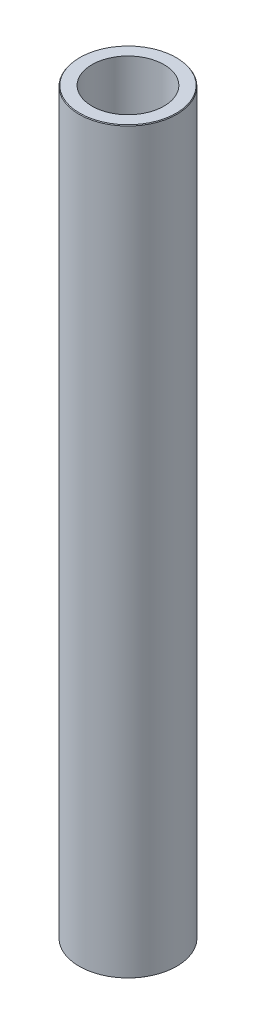
ISO-10303-21;
HEADER;
FILE_DESCRIPTION(('STEP AP214'),'2;1');
FILE_NAME('part.step','',(''),(''),'','','');
FILE_SCHEMA(('AUTOMOTIVE_DESIGN { 1 0 10303 214 1 1 1 1 }'));
ENDSEC;
DATA;
#1=APPLICATION_CONTEXT('core data for automotive mechanical design processes');
#2=APPLICATION_PROTOCOL_DEFINITION('international standard','automotive_design',2000,#1);
#3=PRODUCT_CONTEXT('',#1,'mechanical');
#4=PRODUCT('Part','Part','',(#3));
#5=PRODUCT_RELATED_PRODUCT_CATEGORY('part','',(#4));
#6=PRODUCT_DEFINITION_FORMATION('','',#4);
#7=PRODUCT_DEFINITION_CONTEXT('part definition',#1,'design');
#8=PRODUCT_DEFINITION('design','',#6,#7);
#9=PRODUCT_DEFINITION_SHAPE('','',#8);
#10=(LENGTH_UNIT() NAMED_UNIT(*) SI_UNIT(.MILLI.,.METRE.));
#11=(NAMED_UNIT(*) PLANE_ANGLE_UNIT() SI_UNIT($,.RADIAN.));
#12=(NAMED_UNIT(*) SI_UNIT($,.STERADIAN.) SOLID_ANGLE_UNIT());
#13=UNCERTAINTY_MEASURE_WITH_UNIT(LENGTH_MEASURE(1.E-05),#10,'distance_accuracy_value','');
#14=(GEOMETRIC_REPRESENTATION_CONTEXT(3) GLOBAL_UNCERTAINTY_ASSIGNED_CONTEXT((#13)) GLOBAL_UNIT_ASSIGNED_CONTEXT((#10,
#11,#12)) REPRESENTATION_CONTEXT('',''));
#15=CARTESIAN_POINT('',(0.,0.,0.));
#16=DIRECTION('',(0.,0.,1.));
#17=DIRECTION('',(1.,0.,0.));
#18=AXIS2_PLACEMENT_3D('',#15,#16,#17);
#19=CARTESIAN_POINT('',(0.,416.626312624314,0.));
#20=DIRECTION('',(0.,-1.,0.));
#21=DIRECTION('',(0.,0.,-1.));
#22=AXIS2_PLACEMENT_3D('',#19,#20,#21);
#23=CYLINDRICAL_SURFACE('',#22,27.5);
#24=CARTESIAN_POINT('',(0.,416.192399737283,0.));
#25=DIRECTION('',(0.,1.,0.));
#26=DIRECTION('',(0.,0.,1.));
#27=AXIS2_PLACEMENT_3D('',#24,#25,#26);
#28=CIRCLE('',#27,27.5);
#29=CARTESIAN_POINT('',(0.,416.192399737283,27.5));
#30=VERTEX_POINT('',#29);
#31=EDGE_CURVE('E50',#30,#30,#28,.F.);
#32=ORIENTED_EDGE('',*,*,#31,.T.);
#33=EDGE_LOOP('',(#32));
#34=FACE_BOUND('',#33,.T.);
#35=CARTESIAN_POINT('',(0.,0.319787583571207,0.));
#36=DIRECTION('',(0.,1.,0.));
#37=DIRECTION('',(0.,0.,1.));
#38=AXIS2_PLACEMENT_3D('',#35,#36,#37);
#39=CIRCLE('',#38,27.5);
#40=CARTESIAN_POINT('',(0.,0.319787583571207,27.5));
#41=VERTEX_POINT('',#40);
#42=EDGE_CURVE('E51',#41,#41,#39,.T.);
#43=ORIENTED_EDGE('',*,*,#42,.T.);
#44=EDGE_LOOP('',(#43));
#45=FACE_BOUND('',#44,.T.);
#46=ADVANCED_FACE('F39',(#34,#45),#23,.T.);
#47=CARTESIAN_POINT('',(0.,416.626312624314,0.));
#48=DIRECTION('',(0.,1.,0.));
#49=DIRECTION('',(0.,0.,1.));
#50=AXIS2_PLACEMENT_3D('',#47,#48,#49);
#51=PLANE('',#50);
#52=CARTESIAN_POINT('',(0.,416.626312624314,0.));
#53=DIRECTION('',(0.,1.,0.));
#54=DIRECTION('',(0.,0.,1.));
#55=AXIS2_PLACEMENT_3D('',#52,#53,#54);
#56=CIRCLE('',#55,27.1802124164288);
#57=CARTESIAN_POINT('',(0.,416.626312624314,27.1802124164288));
#58=VERTEX_POINT('',#57);
#59=EDGE_CURVE('E54',#58,#58,#56,.T.);
#60=ORIENTED_EDGE('',*,*,#59,.T.);
#61=EDGE_LOOP('',(#60));
#62=FACE_BOUND('',#61,.T.);
#63=CARTESIAN_POINT('',(0.,416.626312624314,0.));
#64=DIRECTION('',(0.,1.,0.));
#65=DIRECTION('',(0.,0.,1.));
#66=AXIS2_PLACEMENT_3D('',#63,#64,#65);
#67=CIRCLE('',#66,20.2937163254766);
#68=CARTESIAN_POINT('',(0.,416.626312624314,20.2937163254766));
#69=VERTEX_POINT('',#68);
#70=EDGE_CURVE('E58',#69,#69,#67,.T.);
#71=ORIENTED_EDGE('',*,*,#70,.F.);
#72=EDGE_LOOP('',(#71));
#73=FACE_BOUND('',#72,.T.);
#74=ADVANCED_FACE('F69',(#62,#73),#51,.T.);
#75=CARTESIAN_POINT('',(0.,0.,0.));
#76=DIRECTION('',(0.,1.,0.));
#77=DIRECTION('',(0.,0.,1.));
#78=AXIS2_PLACEMENT_3D('',#75,#76,#77);
#79=PLANE('',#78);
#80=CARTESIAN_POINT('',(0.,0.,0.));
#81=DIRECTION('',(0.,1.,0.));
#82=DIRECTION('',(0.,0.,1.));
#83=AXIS2_PLACEMENT_3D('',#80,#81,#82);
#84=CIRCLE('',#83,27.0660871129696);
#85=CARTESIAN_POINT('',(0.,0.,27.0660871129696));
#86=VERTEX_POINT('',#85);
#87=EDGE_CURVE('E10',#86,#86,#84,.F.);
#88=ORIENTED_EDGE('',*,*,#87,.T.);
#89=EDGE_LOOP('',(#88));
#90=FACE_BOUND('',#89,.T.);
#91=CARTESIAN_POINT('',(0.,0.,0.));
#92=DIRECTION('',(0.,1.,0.));
#93=DIRECTION('',(0.,0.,1.));
#94=AXIS2_PLACEMENT_3D('',#91,#92,#93);
#95=CIRCLE('',#94,20.2937163254766);
#96=CARTESIAN_POINT('',(0.,0.,20.2937163254766));
#97=VERTEX_POINT('',#96);
#98=EDGE_CURVE('E63',#97,#97,#95,.T.);
#99=ORIENTED_EDGE('',*,*,#98,.T.);
#100=EDGE_LOOP('',(#99));
#101=FACE_BOUND('',#100,.T.);
#102=ADVANCED_FACE('F75',(#90,#101),#79,.F.);
#103=CARTESIAN_POINT('',(0.,416.626312624314,0.));
#104=DIRECTION('',(0.,-1.,0.));
#105=DIRECTION('',(0.,0.,-1.));
#106=AXIS2_PLACEMENT_3D('',#103,#104,#105);
#107=CYLINDRICAL_SURFACE('',#106,20.2937163254766);
#108=ORIENTED_EDGE('',*,*,#70,.T.);
#109=EDGE_LOOP('',(#108));
#110=FACE_BOUND('',#109,.T.);
#111=ORIENTED_EDGE('',*,*,#98,.F.);
#112=EDGE_LOOP('',(#111));
#113=FACE_BOUND('',#112,.T.);
#114=ADVANCED_FACE('F70',(#110,#113),#107,.F.);
#115=CARTESIAN_POINT('',(0.,416.626312624314,0.));
#116=DIRECTION('',(0.,-1.,0.));
#117=DIRECTION('',(0.,0.,-1.));
#118=AXIS2_PLACEMENT_3D('',#115,#116,#117);
#119=CONICAL_SURFACE('',#118,27.1802124164288,0.63511978113383);
#120=ORIENTED_EDGE('',*,*,#31,.F.);
#121=EDGE_LOOP('',(#120));
#122=FACE_BOUND('',#121,.T.);
#123=ORIENTED_EDGE('',*,*,#59,.F.);
#124=EDGE_LOOP('',(#123));
#125=FACE_BOUND('',#124,.T.);
#126=ADVANCED_FACE('F81',(#122,#125),#119,.T.);
#127=CARTESIAN_POINT('',(0.,0.319787583571207,0.));
#128=DIRECTION('',(0.,1.,0.));
#129=DIRECTION('',(0.,0.,1.));
#130=AXIS2_PLACEMENT_3D('',#127,#128,#129);
#131=CONICAL_SURFACE('',#130,27.5,0.935676545661138);
#132=ORIENTED_EDGE('',*,*,#87,.F.);
#133=EDGE_LOOP('',(#132));
#134=FACE_BOUND('',#133,.T.);
#135=ORIENTED_EDGE('',*,*,#42,.F.);
#136=EDGE_LOOP('',(#135));
#137=FACE_BOUND('',#136,.T.);
#138=ADVANCED_FACE('F45',(#134,#137),#131,.T.);
#139=CLOSED_SHELL('',(#46,#74,#102,#114,#126,#138));
#140=MANIFOLD_SOLID_BREP('B2',#139);
#141=ADVANCED_BREP_SHAPE_REPRESENTATION('',(#18,#140),#14);
#142=SHAPE_DEFINITION_REPRESENTATION(#9,#141);
ENDSEC;
END-ISO-10303-21;
